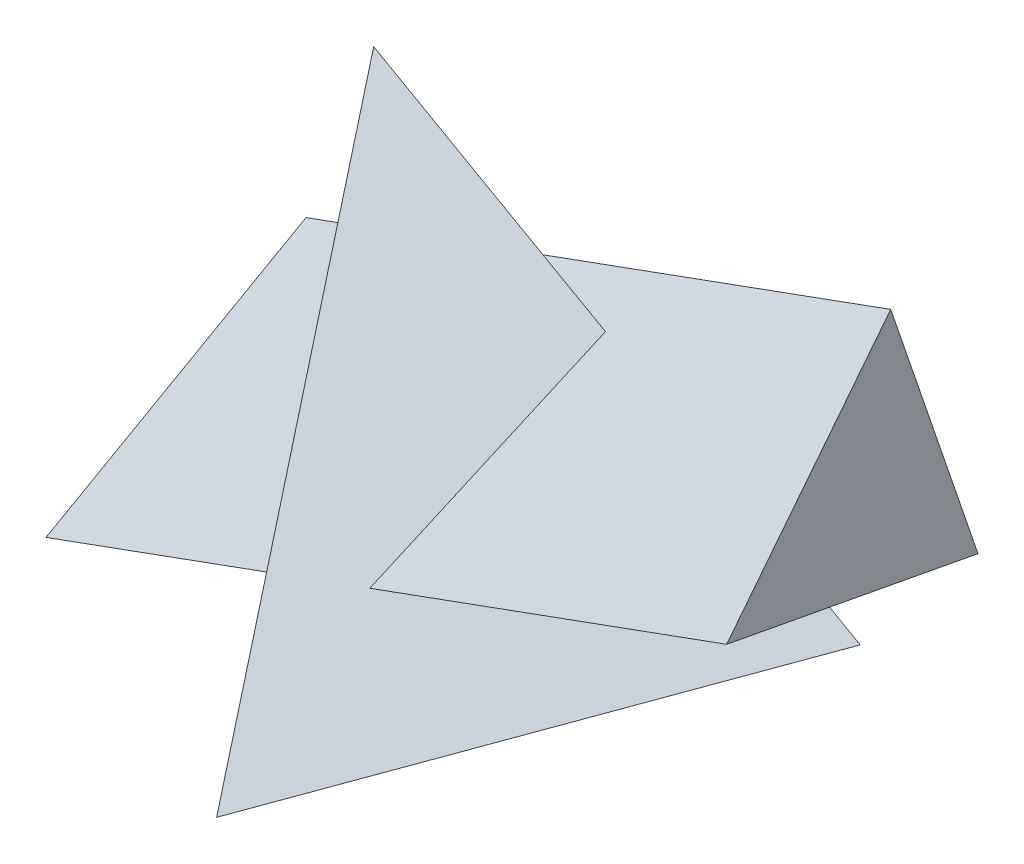
ISO-10303-21;
HEADER;
FILE_DESCRIPTION(('STEP AP214'),'2;1');
FILE_NAME('part.step','',(''),(''),'','','');
FILE_SCHEMA(('AUTOMOTIVE_DESIGN { 1 0 10303 214 1 1 1 1 }'));
ENDSEC;
DATA;
#1=APPLICATION_CONTEXT('core data for automotive mechanical design processes');
#2=APPLICATION_PROTOCOL_DEFINITION('international standard','automotive_design',2000,#1);
#3=PRODUCT_CONTEXT('',#1,'mechanical');
#4=PRODUCT('Part','Part','',(#3));
#5=PRODUCT_RELATED_PRODUCT_CATEGORY('part','',(#4));
#6=PRODUCT_DEFINITION_FORMATION('','',#4);
#7=PRODUCT_DEFINITION_CONTEXT('part definition',#1,'design');
#8=PRODUCT_DEFINITION('design','',#6,#7);
#9=PRODUCT_DEFINITION_SHAPE('','',#8);
#10=(LENGTH_UNIT() NAMED_UNIT(*) SI_UNIT(.MILLI.,.METRE.));
#11=(NAMED_UNIT(*) PLANE_ANGLE_UNIT() SI_UNIT($,.RADIAN.));
#12=(NAMED_UNIT(*) SI_UNIT($,.STERADIAN.) SOLID_ANGLE_UNIT());
#13=UNCERTAINTY_MEASURE_WITH_UNIT(LENGTH_MEASURE(1.E-05),#10,'distance_accuracy_value','');
#14=(GEOMETRIC_REPRESENTATION_CONTEXT(3) GLOBAL_UNCERTAINTY_ASSIGNED_CONTEXT((#13)) GLOBAL_UNIT_ASSIGNED_CONTEXT((#10,
#11,#12)) REPRESENTATION_CONTEXT('',''));
#15=CARTESIAN_POINT('',(0.,0.,0.));
#16=DIRECTION('',(0.,0.,1.));
#17=DIRECTION('',(1.,0.,0.));
#18=AXIS2_PLACEMENT_3D('',#15,#16,#17);
#19=CARTESIAN_POINT('',(0.,0.,0.));
#20=DIRECTION('',(-0.116977778440507,0.321393804843266,-0.93969262078591));
#21=DIRECTION('',(0.,0.946188648339467,0.32361557711818));
#22=AXIS2_PLACEMENT_3D('',#19,#20,#21);
#23=PLANE('',#22);
#24=DIRECTION('',(0.93969262078591,0.342020143325663,0.));
#25=VECTOR('',#24,1.);
#26=CARTESIAN_POINT('',(0.,0.,0.));
#27=LINE('',#26,#25);
#28=CARTESIAN_POINT('',(0.,0.,0.));
#29=VERTEX_POINT('',#28);
#30=CARTESIAN_POINT('',(71.0230352640969,25.8502707833696,0.));
#31=VERTEX_POINT('',#30);
#32=EDGE_CURVE('E123',#29,#31,#27,.T.);
#33=ORIENTED_EDGE('',*,*,#32,.F.);
#34=DIRECTION('',(0.354590559946383,0.897339955722762,0.262767080625376));
#35=VECTOR('',#34,1.);
#36=CARTESIAN_POINT('',(0.,0.,0.));
#37=LINE('',#36,#35);
#38=CARTESIAN_POINT('',(30.,75.9191070279858,22.2313093161681));
#39=VERTEX_POINT('',#38);
#40=EDGE_CURVE('E111',#29,#39,#37,.T.);
#41=ORIENTED_EDGE('',*,*,#40,.T.);
#42=DIRECTION('',(0.93969262078591,0.342020143325663,0.));
#43=VECTOR('',#42,1.);
#44=CARTESIAN_POINT('',(0.,65.,22.2313093161681));
#45=LINE('',#44,#43);
#46=CARTESIAN_POINT('',(61.553297228884,87.4035680122536,22.2313093161681));
#47=VERTEX_POINT('',#46);
#48=EDGE_CURVE('E131',#39,#47,#45,.T.);
#49=ORIENTED_EDGE('',*,*,#48,.T.);
#50=DIRECTION('',(0.143206376645812,-0.930841448197776,-0.336193593045801));
#51=VECTOR('',#50,1.);
#52=CARTESIAN_POINT('',(73.0123940853787,12.9194384450381,-4.67025076430938));
#53=LINE('',#52,#51);
#54=EDGE_CURVE('E127',#47,#31,#53,.T.);
#55=ORIENTED_EDGE('',*,*,#54,.T.);
#56=EDGE_LOOP('',(#33,#41,#49,#55));
#57=FACE_BOUND('',#56,.T.);
#58=ADVANCED_FACE('F40',(#57),#23,.T.);
#59=CARTESIAN_POINT('',(0.,12.0115145087666,64.0125039457935));
#60=DIRECTION('',(0.336824088833459,-0.925416578398325,0.173648177666936));
#61=DIRECTION('',(0.939692620785911,0.342020143325663,0.));
#62=AXIS2_PLACEMENT_3D('',#59,#60,#61);
#63=PLANE('',#62);
#64=DIRECTION('',(0.93969262078591,0.342020143325663,0.));
#65=VECTOR('',#64,1.);
#66=CARTESIAN_POINT('',(0.,12.0115145087666,64.0125039457935));
#67=LINE('',#66,#65);
#68=CARTESIAN_POINT('',(5.54377592712304,14.0292839316808,64.0125039457935));
#69=VERTEX_POINT('',#68);
#70=CARTESIAN_POINT('',(69.2730984055711,37.2248603637875,64.0125039457935));
#71=VERTEX_POINT('',#70);
#72=EDGE_CURVE('E63',#69,#71,#67,.T.);
#73=ORIENTED_EDGE('',*,*,#72,.F.);
#74=DIRECTION('',(-0.0842955860498878,-0.213321520643607,-0.973338678468499));
#75=VECTOR('',#74,1.);
#76=CARTESIAN_POINT('',(5.4680996083857,13.8377746469574,63.1386896510857));
#77=LINE('',#76,#75);
#78=EDGE_CURVE('E56',#69,#29,#77,.T.);
#79=ORIENTED_EDGE('',*,*,#78,.T.);
#80=ORIENTED_EDGE('',*,*,#32,.T.);
#81=DIRECTION('',(-0.0269060487377883,0.174889316795624,0.984220397782976));
#82=VECTOR('',#81,1.);
#83=CARTESIAN_POINT('',(71.0932597001239,25.3938119491947,-2.56880239213344));
#84=LINE('',#83,#82);
#85=EDGE_CURVE('E144',#31,#71,#84,.T.);
#86=ORIENTED_EDGE('',*,*,#85,.T.);
#87=EDGE_LOOP('',(#73,#79,#80,#86));
#88=FACE_BOUND('',#87,.T.);
#89=ADVANCED_FACE('F121',(#88),#63,.T.);
#90=CARTESIAN_POINT('',(0.,65.,22.2313093161681));
#91=DIRECTION('',(-0.219846310392952,0.60402277355506,0.766044443118974));
#92=DIRECTION('',(0.,-0.785256110753261,0.619171091480104));
#93=AXIS2_PLACEMENT_3D('',#90,#91,#92);
#94=PLANE('',#93);
#95=ORIENTED_EDGE('',*,*,#48,.F.);
#96=DIRECTION('',(-0.311244499114121,-0.78764681467056,0.531732411190554));
#97=VECTOR('',#96,1.);
#98=CARTESIAN_POINT('',(24.4169787035287,61.7905073164417,31.7693843155672));
#99=LINE('',#98,#97);
#100=EDGE_CURVE('E113',#39,#69,#99,.T.);
#101=ORIENTED_EDGE('',*,*,#100,.T.);
#102=ORIENTED_EDGE('',*,*,#72,.T.);
#103=DIRECTION('',(-0.117410015792679,0.763165102652415,-0.635447806106128));
#104=VECTOR('',#103,1.);
#105=CARTESIAN_POINT('',(66.8777877444058,52.7943796613619,51.0485766836782));
#106=LINE('',#105,#104);
#107=EDGE_CURVE('E139',#71,#47,#106,.T.);
#108=ORIENTED_EDGE('',*,*,#107,.T.);
#109=EDGE_LOOP('',(#95,#101,#102,#108));
#110=FACE_BOUND('',#109,.T.);
#111=ADVANCED_FACE('F267',(#110),#94,.T.);
#112=CARTESIAN_POINT('',(18.7499999999996,-32.4759526419162,0.));
#113=DIRECTION('',(0.499999999999995,-0.866025403784441,0.));
#114=DIRECTION('',(0.866025403784441,0.499999999999995,0.));
#115=AXIS2_PLACEMENT_3D('',#112,#113,#114);
#116=PLANE('',#115);
#117=DIRECTION('',(-0.774596669241487,-0.447213595499954,0.447213595499954));
#118=VECTOR('',#117,1.);
#119=CARTESIAN_POINT('',(75.,0.,90.));
#120=LINE('',#119,#118);
#121=CARTESIAN_POINT('',(178.923048454134,60.,30.));
#122=VERTEX_POINT('',#121);
#123=CARTESIAN_POINT('',(75.,0.,90.));
#124=VERTEX_POINT('',#123);
#125=EDGE_CURVE('E192',#122,#124,#120,.T.);
#126=ORIENTED_EDGE('',*,*,#125,.T.);
#127=DIRECTION('',(0.,0.,-1.));
#128=VECTOR('',#127,1.);
#129=CARTESIAN_POINT('',(75.,0.,-30.));
#130=LINE('',#129,#128);
#131=CARTESIAN_POINT('',(75.,0.,-30.));
#132=VERTEX_POINT('',#131);
#133=EDGE_CURVE('E153',#124,#132,#130,.T.);
#134=ORIENTED_EDGE('',*,*,#133,.T.);
#135=DIRECTION('',(0.774596669241487,0.447213595499954,0.447213595499954));
#136=VECTOR('',#135,1.);
#137=CARTESIAN_POINT('',(178.923048454134,60.,30.));
#138=LINE('',#137,#136);
#139=EDGE_CURVE('E198',#132,#122,#138,.T.);
#140=ORIENTED_EDGE('',*,*,#139,.T.);
#141=EDGE_LOOP('',(#126,#134,#140));
#142=FACE_BOUND('',#141,.T.);
#143=ADVANCED_FACE('F171',(#142),#116,.T.);
#144=CARTESIAN_POINT('',(73.2658959537572,11.2716763005781,0.));
#145=DIRECTION('',(-0.988371697650617,-0.152057184253941,0.));
#146=DIRECTION('',(0.152057184253941,-0.988371697650617,0.));
#147=AXIS2_PLACEMENT_3D('',#144,#145,#146);
#148=PLANE('',#147);
#149=ORIENTED_EDGE('',*,*,#85,.F.);
#150=ORIENTED_EDGE('',*,*,#54,.F.);
#151=ORIENTED_EDGE('',*,*,#107,.F.);
#152=EDGE_LOOP('',(#149,#150,#151));
#153=FACE_BOUND('',#152,.T.);
#154=DIRECTION('',(-0.138342892773215,0.899228803025897,-0.415028678319645));
#155=VECTOR('',#154,1.);
#156=CARTESIAN_POINT('',(75.,0.,90.));
#157=LINE('',#156,#155);
#158=CARTESIAN_POINT('',(55.,130.,30.));
#159=VERTEX_POINT('',#158);
#160=EDGE_CURVE('E159',#124,#159,#157,.T.);
#161=ORIENTED_EDGE('',*,*,#160,.T.);
#162=DIRECTION('',(-0.138342892773215,0.899228803025897,0.415028678319645));
#163=VECTOR('',#162,1.);
#164=CARTESIAN_POINT('',(75.,0.,-30.));
#165=LINE('',#164,#163);
#166=EDGE_CURVE('E242',#132,#159,#165,.T.);
#167=ORIENTED_EDGE('',*,*,#166,.F.);
#168=ORIENTED_EDGE('',*,*,#133,.F.);
#169=EDGE_LOOP('',(#161,#167,#168));
#170=FACE_BOUND('',#169,.T.);
#171=ADVANCED_FACE('F161',(#153,#170),#148,.T.);
#172=CARTESIAN_POINT('',(10.9794735759596,19.4372833707789,-38.4542894447011));
#173=DIRECTION('',(0.246926889556215,0.43714189855862,-0.864831817024939));
#174=DIRECTION('',(0.,0.892467876886252,0.451110949463816));
#175=AXIS2_PLACEMENT_3D('',#172,#173,#174);
#176=PLANE('',#175);
#177=DIRECTION('',(-0.82148539726632,-0.378950391518162,-0.426096635572763));
#178=VECTOR('',#177,1.);
#179=CARTESIAN_POINT('',(23.2003244406058,0.0438758537258284,-44.767672211504));
#180=LINE('',#179,#178);
#181=CARTESIAN_POINT('',(167.347322519535,66.5387417879881,30.));
#182=VERTEX_POINT('',#181);
#183=CARTESIAN_POINT('',(109.509358404043,39.8581468326601,0.));
#184=VERTEX_POINT('',#183);
#185=EDGE_CURVE('E141',#182,#184,#180,.T.);
#186=ORIENTED_EDGE('',*,*,#185,.F.);
#187=DIRECTION('',(-0.87069361780604,0.491825806471997,0.));
#188=VECTOR('',#187,1.);
#189=CARTESIAN_POINT('',(178.923048454134,60.,30.));
#190=LINE('',#189,#188);
#191=EDGE_CURVE('E223',#122,#182,#190,.T.);
#192=ORIENTED_EDGE('',*,*,#191,.F.);
#193=ORIENTED_EDGE('',*,*,#139,.F.);
#194=ORIENTED_EDGE('',*,*,#166,.T.);
#195=CARTESIAN_POINT('',(114.035319338853,96.6529156176368,30.));
#196=VERTEX_POINT('',#195);
#197=EDGE_CURVE('E147',#196,#159,#190,.T.);
#198=ORIENTED_EDGE('',*,*,#197,.F.);
#199=DIRECTION('',(0.961426906075268,0.00109137176931576,0.275058381406929));
#200=VECTOR('',#199,1.);
#201=CARTESIAN_POINT('',(0.592847620676504,96.5241404499228,-2.45520013682665));
#202=LINE('',#201,#200);
#203=CARTESIAN_POINT('',(86.8809813753702,96.6220911444704,22.2313093161681));
#204=VERTEX_POINT('',#203);
#205=EDGE_CURVE('E136',#204,#196,#202,.T.);
#206=ORIENTED_EDGE('',*,*,#205,.F.);
#207=DIRECTION('',(-0.347988066035532,0.87293822162262,0.341881802860561));
#208=VECTOR('',#207,1.);
#209=CARTESIAN_POINT('',(108.356038945557,42.7512823603317,1.13308177557139));
#210=LINE('',#209,#208);
#211=EDGE_CURVE('E12',#184,#204,#210,.T.);
#212=ORIENTED_EDGE('',*,*,#211,.F.);
#213=EDGE_LOOP('',(#186,#192,#193,#194,#198,#206,#212));
#214=FACE_BOUND('',#213,.T.);
#215=ADVANCED_FACE('F170',(#214),#176,.T.);
#216=CARTESIAN_POINT('',(23.7924874099926,42.1205367164699,83.3303337490206));
#217=DIRECTION('',(0.246926889556215,0.43714189855862,0.864831817024939));
#218=DIRECTION('',(0.,-0.892467876886252,0.451110949463816));
#219=AXIS2_PLACEMENT_3D('',#216,#217,#218);
#220=PLANE('',#219);
#221=DIRECTION('',(0.889367557948941,0.252139907423014,-0.381380143626606));
#222=VECTOR('',#221,1.);
#223=CARTESIAN_POINT('',(30.2344622195623,27.6665976519136,88.7969753190172));
#224=LINE('',#223,#222);
#225=CARTESIAN_POINT('',(88.0311387078913,44.0522286869977,64.0125039457935));
#226=VERTEX_POINT('',#225);
#227=EDGE_CURVE('E49',#226,#182,#224,.T.);
#228=ORIENTED_EDGE('',*,*,#227,.F.);
#229=DIRECTION('',(-0.383414889429725,-0.775563239221083,0.501492457104285));
#230=VECTOR('',#229,1.);
#231=CARTESIAN_POINT('',(74.298769968664,16.2746940236614,81.9739330158541));
#232=LINE('',#231,#230);
#233=EDGE_CURVE('E197',#196,#226,#232,.T.);
#234=ORIENTED_EDGE('',*,*,#233,.F.);
#235=ORIENTED_EDGE('',*,*,#197,.T.);
#236=ORIENTED_EDGE('',*,*,#160,.F.);
#237=ORIENTED_EDGE('',*,*,#125,.F.);
#238=ORIENTED_EDGE('',*,*,#191,.T.);
#239=EDGE_LOOP('',(#228,#234,#235,#236,#237,#238));
#240=FACE_BOUND('',#239,.T.);
#241=ADVANCED_FACE('F42',(#240),#220,.T.);
#242=CARTESIAN_POINT('',(178.923048454134,0.,0.));
#243=DIRECTION('',(-1.,0.,0.));
#244=DIRECTION('',(0.,0.,1.));
#245=AXIS2_PLACEMENT_3D('',#242,#243,#244);
#246=PLANE('',#245);
#247=DIRECTION('',(0.,-0.184424547807922,-0.982846674800217));
#248=VECTOR('',#247,1.);
#249=CARTESIAN_POINT('',(178.923048454134,77.1341783702396,64.0125039457935));
#250=LINE('',#249,#248);
#251=CARTESIAN_POINT('',(178.923048454134,77.1341783702396,64.0125039457935));
#252=VERTEX_POINT('',#251);
#253=CARTESIAN_POINT('',(178.923048454134,65.122663861473,0.));
#254=VERTEX_POINT('',#253);
#255=EDGE_CURVE('E117',#252,#254,#250,.T.);
#256=ORIENTED_EDGE('',*,*,#255,.T.);
#257=DIRECTION('',(0.,0.946188648339467,0.32361557711818));
#258=VECTOR('',#257,1.);
#259=CARTESIAN_POINT('',(178.923048454134,65.122663861473,0.));
#260=LINE('',#259,#258);
#261=CARTESIAN_POINT('',(178.923048454134,130.122663861473,22.2313093161681));
#262=VERTEX_POINT('',#261);
#263=EDGE_CURVE('E258',#254,#262,#260,.T.);
#264=ORIENTED_EDGE('',*,*,#263,.T.);
#265=DIRECTION('',(0.,-0.785256110753261,0.619171091480104));
#266=VECTOR('',#265,1.);
#267=CARTESIAN_POINT('',(178.923048454134,130.122663861473,22.2313093161681));
#268=LINE('',#267,#266);
#269=EDGE_CURVE('E133',#262,#252,#268,.T.);
#270=ORIENTED_EDGE('',*,*,#269,.T.);
#271=EDGE_LOOP('',(#256,#264,#270));
#272=FACE_BOUND('',#271,.T.);
#273=ADVANCED_FACE('F261',(#272),#246,.F.);
#274=EDGE_CURVE('E128',#204,#262,#45,.T.);
#275=ORIENTED_EDGE('',*,*,#274,.F.);
#276=ORIENTED_EDGE('',*,*,#205,.T.);
#277=ORIENTED_EDGE('',*,*,#233,.T.);
#278=EDGE_CURVE('E266',#226,#252,#67,.T.);
#279=ORIENTED_EDGE('',*,*,#278,.T.);
#280=ORIENTED_EDGE('',*,*,#269,.F.);
#281=EDGE_LOOP('',(#275,#276,#277,#279,#280));
#282=FACE_BOUND('',#281,.T.);
#283=ADVANCED_FACE('F249',(#282),#94,.T.);
#284=ORIENTED_EDGE('',*,*,#227,.T.);
#285=ORIENTED_EDGE('',*,*,#185,.T.);
#286=EDGE_CURVE('E129',#184,#254,#27,.T.);
#287=ORIENTED_EDGE('',*,*,#286,.T.);
#288=ORIENTED_EDGE('',*,*,#255,.F.);
#289=ORIENTED_EDGE('',*,*,#278,.F.);
#290=EDGE_LOOP('',(#284,#285,#287,#288,#289));
#291=FACE_BOUND('',#290,.T.);
#292=ADVANCED_FACE('F274',(#291),#63,.T.);
#293=ORIENTED_EDGE('',*,*,#286,.F.);
#294=ORIENTED_EDGE('',*,*,#211,.T.);
#295=ORIENTED_EDGE('',*,*,#274,.T.);
#296=ORIENTED_EDGE('',*,*,#263,.F.);
#297=EDGE_LOOP('',(#293,#294,#295,#296));
#298=FACE_BOUND('',#297,.T.);
#299=ADVANCED_FACE('F257',(#298),#23,.T.);
#300=CARTESIAN_POINT('',(0.,0.,90.00011));
#301=DIRECTION('',(-0.930021568239615,0.36750494229211,0.));
#302=DIRECTION('',(-0.36750494229211,-0.930021568239615,0.));
#303=AXIS2_PLACEMENT_3D('',#300,#301,#302);
#304=PLANE('',#303);
#305=ORIENTED_EDGE('',*,*,#78,.F.);
#306=ORIENTED_EDGE('',*,*,#100,.F.);
#307=ORIENTED_EDGE('',*,*,#40,.F.);
#308=EDGE_LOOP('',(#305,#306,#307));
#309=FACE_BOUND('',#308,.T.);
#310=ADVANCED_FACE('F112',(#309),#304,.T.);
#311=CLOSED_SHELL('',(#58,#89,#111,#143,#171,#215,#241,#273,#283,#292,#299,#310));
#312=MANIFOLD_SOLID_BREP('B2',#311);
#313=ADVANCED_BREP_SHAPE_REPRESENTATION('',(#18,#312),#14);
#314=SHAPE_DEFINITION_REPRESENTATION(#9,#313);
ENDSEC;
END-ISO-10303-21;
